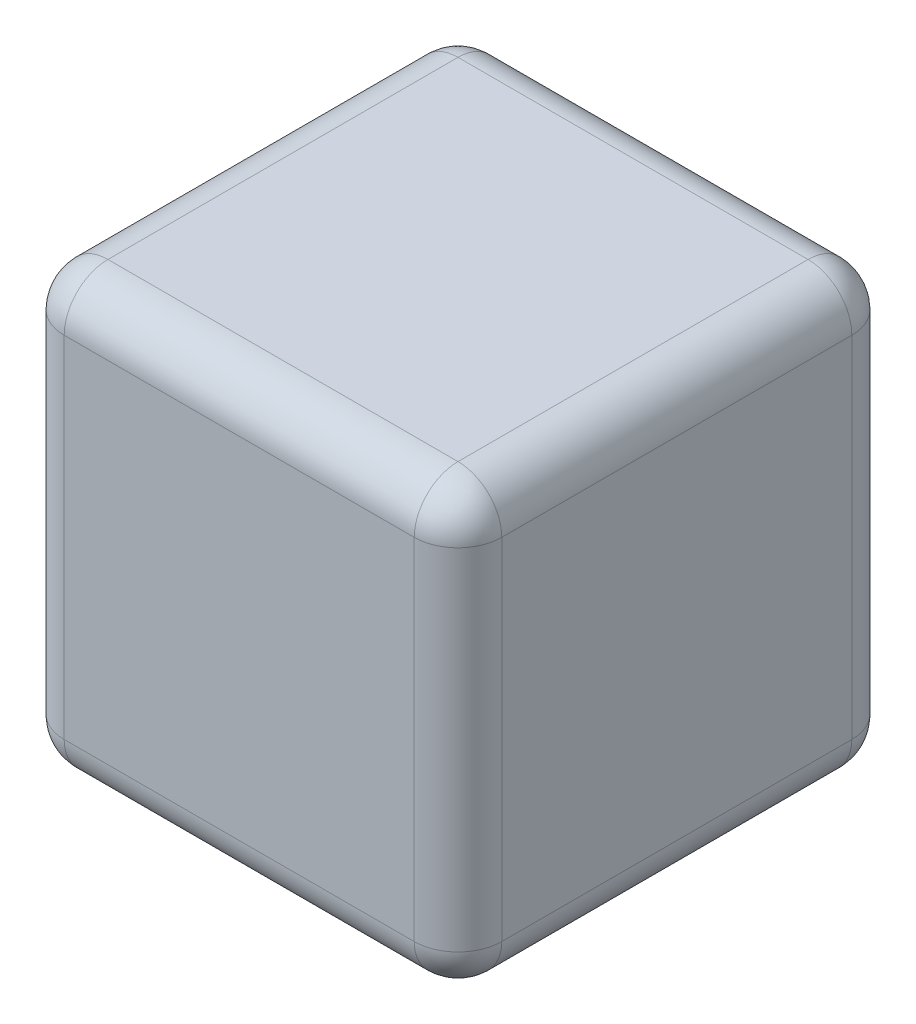
ISO-10303-21;
HEADER;
FILE_DESCRIPTION(('STEP AP214'),'2;1');
FILE_NAME('part.step','',(''),(''),'','','');
FILE_SCHEMA(('AUTOMOTIVE_DESIGN { 1 0 10303 214 1 1 1 1 }'));
ENDSEC;
DATA;
#1=APPLICATION_CONTEXT('core data for automotive mechanical design processes');
#2=APPLICATION_PROTOCOL_DEFINITION('international standard','automotive_design',2000,#1);
#3=PRODUCT_CONTEXT('',#1,'mechanical');
#4=PRODUCT('Part','Part','',(#3));
#5=PRODUCT_RELATED_PRODUCT_CATEGORY('part','',(#4));
#6=PRODUCT_DEFINITION_FORMATION('','',#4);
#7=PRODUCT_DEFINITION_CONTEXT('part definition',#1,'design');
#8=PRODUCT_DEFINITION('design','',#6,#7);
#9=PRODUCT_DEFINITION_SHAPE('','',#8);
#10=(LENGTH_UNIT() NAMED_UNIT(*) SI_UNIT(.MILLI.,.METRE.));
#11=(NAMED_UNIT(*) PLANE_ANGLE_UNIT() SI_UNIT($,.RADIAN.));
#12=(NAMED_UNIT(*) SI_UNIT($,.STERADIAN.) SOLID_ANGLE_UNIT());
#13=UNCERTAINTY_MEASURE_WITH_UNIT(LENGTH_MEASURE(1.E-05),#10,'distance_accuracy_value','');
#14=(GEOMETRIC_REPRESENTATION_CONTEXT(3) GLOBAL_UNCERTAINTY_ASSIGNED_CONTEXT((#13)) GLOBAL_UNIT_ASSIGNED_CONTEXT((#10,
#11,#12)) REPRESENTATION_CONTEXT('',''));
#15=CARTESIAN_POINT('',(0.,0.,0.));
#16=DIRECTION('',(0.,0.,1.));
#17=DIRECTION('',(1.,0.,0.));
#18=AXIS2_PLACEMENT_3D('',#15,#16,#17);
#19=CARTESIAN_POINT('',(25.4,25.4,0.));
#20=DIRECTION('',(0.,0.,-1.));
#21=DIRECTION('',(-1.,0.,0.));
#22=AXIS2_PLACEMENT_3D('',#19,#20,#21);
#23=PLANE('',#22);
#24=DIRECTION('',(1.,0.,0.));
#25=VECTOR('',#24,1.);
#26=CARTESIAN_POINT('',(25.4,22.86,0.));
#27=LINE('',#26,#25);
#28=CARTESIAN_POINT('',(22.86,22.86,0.));
#29=VERTEX_POINT('',#28);
#30=CARTESIAN_POINT('',(2.54,22.86,0.));
#31=VERTEX_POINT('',#30);
#32=EDGE_CURVE('E265',#29,#31,#27,.F.);
#33=ORIENTED_EDGE('',*,*,#32,.T.);
#34=DIRECTION('',(0.,-1.,0.));
#35=VECTOR('',#34,1.);
#36=CARTESIAN_POINT('',(2.54,25.4,0.));
#37=LINE('',#36,#35);
#38=CARTESIAN_POINT('',(2.54,2.54,0.));
#39=VERTEX_POINT('',#38);
#40=EDGE_CURVE('E170',#31,#39,#37,.T.);
#41=ORIENTED_EDGE('',*,*,#40,.T.);
#42=DIRECTION('',(1.,0.,0.));
#43=VECTOR('',#42,1.);
#44=CARTESIAN_POINT('',(25.4,2.54,0.));
#45=LINE('',#44,#43);
#46=CARTESIAN_POINT('',(22.86,2.54,0.));
#47=VERTEX_POINT('',#46);
#48=EDGE_CURVE('E271',#39,#47,#45,.T.);
#49=ORIENTED_EDGE('',*,*,#48,.T.);
#50=DIRECTION('',(0.,-1.,0.));
#51=VECTOR('',#50,1.);
#52=CARTESIAN_POINT('',(22.86,25.4,0.));
#53=LINE('',#52,#51);
#54=EDGE_CURVE('E268',#47,#29,#53,.F.);
#55=ORIENTED_EDGE('',*,*,#54,.T.);
#56=EDGE_LOOP('',(#33,#41,#49,#55));
#57=FACE_BOUND('',#56,.T.);
#58=ADVANCED_FACE('F45',(#57),#23,.F.);
#59=CARTESIAN_POINT('',(25.4,25.4,-25.4));
#60=DIRECTION('',(-1.,0.,0.));
#61=DIRECTION('',(0.,0.,1.));
#62=AXIS2_PLACEMENT_3D('',#59,#60,#61);
#63=PLANE('',#62);
#64=DIRECTION('',(0.,-1.,0.));
#65=VECTOR('',#64,1.);
#66=CARTESIAN_POINT('',(25.4,25.4,-2.54));
#67=LINE('',#66,#65);
#68=CARTESIAN_POINT('',(25.4,22.86,-2.54));
#69=VERTEX_POINT('',#68);
#70=CARTESIAN_POINT('',(25.4,2.54,-2.54));
#71=VERTEX_POINT('',#70);
#72=EDGE_CURVE('E281',#69,#71,#67,.T.);
#73=ORIENTED_EDGE('',*,*,#72,.T.);
#74=DIRECTION('',(0.,0.,-1.));
#75=VECTOR('',#74,1.);
#76=CARTESIAN_POINT('',(25.4,2.54,-25.4));
#77=LINE('',#76,#75);
#78=CARTESIAN_POINT('',(25.4,2.54,-22.86));
#79=VERTEX_POINT('',#78);
#80=EDGE_CURVE('E285',#71,#79,#77,.T.);
#81=ORIENTED_EDGE('',*,*,#80,.T.);
#82=DIRECTION('',(0.,-1.,0.));
#83=VECTOR('',#82,1.);
#84=CARTESIAN_POINT('',(25.4,25.4,-22.86));
#85=LINE('',#84,#83);
#86=CARTESIAN_POINT('',(25.4,22.86,-22.86));
#87=VERTEX_POINT('',#86);
#88=EDGE_CURVE('E245',#79,#87,#85,.F.);
#89=ORIENTED_EDGE('',*,*,#88,.T.);
#90=DIRECTION('',(0.,0.,-1.));
#91=VECTOR('',#90,1.);
#92=CARTESIAN_POINT('',(25.4,22.86,-25.4));
#93=LINE('',#92,#91);
#94=EDGE_CURVE('E276',#87,#69,#93,.F.);
#95=ORIENTED_EDGE('',*,*,#94,.T.);
#96=EDGE_LOOP('',(#73,#81,#89,#95));
#97=FACE_BOUND('',#96,.T.);
#98=ADVANCED_FACE('F369',(#97),#63,.F.);
#99=CARTESIAN_POINT('',(0.,25.4,-25.4));
#100=DIRECTION('',(0.,0.,1.));
#101=DIRECTION('',(1.,0.,0.));
#102=AXIS2_PLACEMENT_3D('',#99,#100,#101);
#103=PLANE('',#102);
#104=DIRECTION('',(-1.,0.,0.));
#105=VECTOR('',#104,1.);
#106=CARTESIAN_POINT('',(0.,2.54,-25.4));
#107=LINE('',#106,#105);
#108=CARTESIAN_POINT('',(22.86,2.54,-25.4));
#109=VERTEX_POINT('',#108);
#110=CARTESIAN_POINT('',(2.54,2.54,-25.4));
#111=VERTEX_POINT('',#110);
#112=EDGE_CURVE('E251',#109,#111,#107,.T.);
#113=ORIENTED_EDGE('',*,*,#112,.T.);
#114=DIRECTION('',(0.,-1.,0.));
#115=VECTOR('',#114,1.);
#116=CARTESIAN_POINT('',(2.54,25.4,-25.4));
#117=LINE('',#116,#115);
#118=CARTESIAN_POINT('',(2.54,22.86,-25.4));
#119=VERTEX_POINT('',#118);
#120=EDGE_CURVE('E256',#111,#119,#117,.F.);
#121=ORIENTED_EDGE('',*,*,#120,.T.);
#122=DIRECTION('',(-1.,0.,0.));
#123=VECTOR('',#122,1.);
#124=CARTESIAN_POINT('',(0.,22.86,-25.4));
#125=LINE('',#124,#123);
#126=CARTESIAN_POINT('',(22.86,22.86,-25.4));
#127=VERTEX_POINT('',#126);
#128=EDGE_CURVE('E252',#119,#127,#125,.F.);
#129=ORIENTED_EDGE('',*,*,#128,.T.);
#130=DIRECTION('',(0.,-1.,0.));
#131=VECTOR('',#130,1.);
#132=CARTESIAN_POINT('',(22.86,25.4,-25.4));
#133=LINE('',#132,#131);
#134=EDGE_CURVE('E247',#127,#109,#133,.T.);
#135=ORIENTED_EDGE('',*,*,#134,.T.);
#136=EDGE_LOOP('',(#113,#121,#129,#135));
#137=FACE_BOUND('',#136,.T.);
#138=ADVANCED_FACE('F349',(#137),#103,.F.);
#139=CARTESIAN_POINT('',(0.,25.4,0.));
#140=DIRECTION('',(1.,0.,0.));
#141=DIRECTION('',(0.,0.,-1.));
#142=AXIS2_PLACEMENT_3D('',#139,#140,#141);
#143=PLANE('',#142);
#144=DIRECTION('',(0.,-1.,0.));
#145=VECTOR('',#144,1.);
#146=CARTESIAN_POINT('',(0.,25.4,-22.86));
#147=LINE('',#146,#145);
#148=CARTESIAN_POINT('',(0.,22.86,-22.86));
#149=VERTEX_POINT('',#148);
#150=CARTESIAN_POINT('',(0.,2.54,-22.86));
#151=VERTEX_POINT('',#150);
#152=EDGE_CURVE('E146',#149,#151,#147,.T.);
#153=ORIENTED_EDGE('',*,*,#152,.T.);
#154=DIRECTION('',(0.,0.,1.));
#155=VECTOR('',#154,1.);
#156=CARTESIAN_POINT('',(0.,2.54,0.));
#157=LINE('',#156,#155);
#158=CARTESIAN_POINT('',(0.,2.54,-2.54));
#159=VERTEX_POINT('',#158);
#160=EDGE_CURVE('E141',#151,#159,#157,.T.);
#161=ORIENTED_EDGE('',*,*,#160,.T.);
#162=DIRECTION('',(0.,-1.,0.));
#163=VECTOR('',#162,1.);
#164=CARTESIAN_POINT('',(0.,25.4,-2.54));
#165=LINE('',#164,#163);
#166=CARTESIAN_POINT('',(0.,22.86,-2.54));
#167=VERTEX_POINT('',#166);
#168=EDGE_CURVE('E135',#159,#167,#165,.F.);
#169=ORIENTED_EDGE('',*,*,#168,.T.);
#170=DIRECTION('',(0.,0.,1.));
#171=VECTOR('',#170,1.);
#172=CARTESIAN_POINT('',(0.,22.86,0.));
#173=LINE('',#172,#171);
#174=EDGE_CURVE('E138',#167,#149,#173,.F.);
#175=ORIENTED_EDGE('',*,*,#174,.T.);
#176=EDGE_LOOP('',(#153,#161,#169,#175));
#177=FACE_BOUND('',#176,.T.);
#178=ADVANCED_FACE('F137',(#177),#143,.F.);
#179=CARTESIAN_POINT('',(0.,25.4,0.));
#180=DIRECTION('',(0.,-1.,0.));
#181=DIRECTION('',(0.,0.,-1.));
#182=AXIS2_PLACEMENT_3D('',#179,#180,#181);
#183=PLANE('',#182);
#184=DIRECTION('',(-1.,0.,0.));
#185=VECTOR('',#184,1.);
#186=CARTESIAN_POINT('',(0.,25.4,-22.86));
#187=LINE('',#186,#185);
#188=CARTESIAN_POINT('',(22.86,25.4,-22.86));
#189=VERTEX_POINT('',#188);
#190=CARTESIAN_POINT('',(2.54,25.4,-22.86));
#191=VERTEX_POINT('',#190);
#192=EDGE_CURVE('E55',#189,#191,#187,.T.);
#193=ORIENTED_EDGE('',*,*,#192,.T.);
#194=DIRECTION('',(0.,0.,1.));
#195=VECTOR('',#194,1.);
#196=CARTESIAN_POINT('',(2.54,25.4,0.));
#197=LINE('',#196,#195);
#198=CARTESIAN_POINT('',(2.54,25.4,-2.54));
#199=VERTEX_POINT('',#198);
#200=EDGE_CURVE('E11',#191,#199,#197,.T.);
#201=ORIENTED_EDGE('',*,*,#200,.T.);
#202=DIRECTION('',(1.,0.,0.));
#203=VECTOR('',#202,1.);
#204=CARTESIAN_POINT('',(0.,25.4,-2.54));
#205=LINE('',#204,#203);
#206=CARTESIAN_POINT('',(22.86,25.4,-2.54));
#207=VERTEX_POINT('',#206);
#208=EDGE_CURVE('E288',#199,#207,#205,.T.);
#209=ORIENTED_EDGE('',*,*,#208,.T.);
#210=DIRECTION('',(0.,0.,-1.));
#211=VECTOR('',#210,1.);
#212=CARTESIAN_POINT('',(22.86,25.4,0.));
#213=LINE('',#212,#211);
#214=EDGE_CURVE('E66',#207,#189,#213,.T.);
#215=ORIENTED_EDGE('',*,*,#214,.T.);
#216=EDGE_LOOP('',(#193,#201,#209,#215));
#217=FACE_BOUND('',#216,.T.);
#218=ADVANCED_FACE('F416',(#217),#183,.F.);
#219=CARTESIAN_POINT('',(0.,0.,0.));
#220=DIRECTION('',(0.,-1.,0.));
#221=DIRECTION('',(0.,0.,-1.));
#222=AXIS2_PLACEMENT_3D('',#219,#220,#221);
#223=PLANE('',#222);
#224=DIRECTION('',(1.,0.,0.));
#225=VECTOR('',#224,1.);
#226=CARTESIAN_POINT('',(0.,0.,-2.54));
#227=LINE('',#226,#225);
#228=CARTESIAN_POINT('',(22.86,0.,-2.54));
#229=VERTEX_POINT('',#228);
#230=CARTESIAN_POINT('',(2.54,0.,-2.54));
#231=VERTEX_POINT('',#230);
#232=EDGE_CURVE('E327',#229,#231,#227,.F.);
#233=ORIENTED_EDGE('',*,*,#232,.T.);
#234=DIRECTION('',(0.,0.,1.));
#235=VECTOR('',#234,1.);
#236=CARTESIAN_POINT('',(2.54,0.,-25.4));
#237=LINE('',#236,#235);
#238=CARTESIAN_POINT('',(2.54,0.,-22.86));
#239=VERTEX_POINT('',#238);
#240=EDGE_CURVE('E258',#231,#239,#237,.F.);
#241=ORIENTED_EDGE('',*,*,#240,.T.);
#242=DIRECTION('',(-1.,0.,0.));
#243=VECTOR('',#242,1.);
#244=CARTESIAN_POINT('',(25.4,0.,-22.86));
#245=LINE('',#244,#243);
#246=CARTESIAN_POINT('',(22.86,0.,-22.86));
#247=VERTEX_POINT('',#246);
#248=EDGE_CURVE('E321',#239,#247,#245,.F.);
#249=ORIENTED_EDGE('',*,*,#248,.T.);
#250=DIRECTION('',(0.,0.,-1.));
#251=VECTOR('',#250,1.);
#252=CARTESIAN_POINT('',(22.86,0.,0.));
#253=LINE('',#252,#251);
#254=EDGE_CURVE('E339',#247,#229,#253,.F.);
#255=ORIENTED_EDGE('',*,*,#254,.T.);
#256=EDGE_LOOP('',(#233,#241,#249,#255));
#257=FACE_BOUND('',#256,.T.);
#258=ADVANCED_FACE('F330',(#257),#223,.T.);
#259=CARTESIAN_POINT('',(22.86,22.86,0.));
#260=DIRECTION('',(0.,0.,-1.));
#261=DIRECTION('',(-1.,0.,0.));
#262=AXIS2_PLACEMENT_3D('',#259,#260,#261);
#263=CYLINDRICAL_SURFACE('',#262,2.54);
#264=CARTESIAN_POINT('',(22.86,22.86,-22.86));
#265=DIRECTION('',(0.,0.,-1.));
#266=DIRECTION('',(-1.,0.,0.));
#267=AXIS2_PLACEMENT_3D('',#264,#265,#266);
#268=CIRCLE('',#267,2.54);
#269=EDGE_CURVE('E49',#189,#87,#268,.T.);
#270=ORIENTED_EDGE('',*,*,#269,.F.);
#271=ORIENTED_EDGE('',*,*,#214,.F.);
#272=CARTESIAN_POINT('',(22.86,22.86,-2.54));
#273=DIRECTION('',(0.,0.,1.));
#274=DIRECTION('',(0.,-1.,0.));
#275=AXIS2_PLACEMENT_3D('',#272,#273,#274);
#276=CIRCLE('',#275,2.54);
#277=EDGE_CURVE('E225',#69,#207,#276,.T.);
#278=ORIENTED_EDGE('',*,*,#277,.F.);
#279=ORIENTED_EDGE('',*,*,#94,.F.);
#280=EDGE_LOOP('',(#270,#271,#278,#279));
#281=FACE_BOUND('',#280,.T.);
#282=ADVANCED_FACE('F47',(#281),#263,.T.);
#283=CARTESIAN_POINT('',(22.86,22.86,-22.86));
#284=DIRECTION('',(1.,0.,0.));
#285=DIRECTION('',(0.,0.,-1.));
#286=AXIS2_PLACEMENT_3D('',#283,#284,#285);
#287=SPHERICAL_SURFACE('',#286,2.54);
#288=CARTESIAN_POINT('',(22.86,22.86,-22.86));
#289=DIRECTION('',(1.,0.,0.));
#290=DIRECTION('',(0.,0.,-1.));
#291=AXIS2_PLACEMENT_3D('',#288,#289,#290);
#292=CIRCLE('',#291,2.54);
#293=EDGE_CURVE('E218',#189,#127,#292,.F.);
#294=ORIENTED_EDGE('',*,*,#293,.F.);
#295=ORIENTED_EDGE('',*,*,#269,.T.);
#296=CARTESIAN_POINT('',(22.86,22.86,-22.86));
#297=DIRECTION('',(0.,1.,0.));
#298=DIRECTION('',(0.,0.,1.));
#299=AXIS2_PLACEMENT_3D('',#296,#297,#298);
#300=CIRCLE('',#299,2.54);
#301=EDGE_CURVE('E222',#127,#87,#300,.F.);
#302=ORIENTED_EDGE('',*,*,#301,.F.);
#303=EDGE_LOOP('',(#294,#295,#302));
#304=FACE_BOUND('',#303,.T.);
#305=ADVANCED_FACE('F237',(#304),#287,.T.);
#306=CARTESIAN_POINT('',(22.86,22.86,-2.54));
#307=DIRECTION('',(0.,1.,0.));
#308=DIRECTION('',(0.,0.,1.));
#309=AXIS2_PLACEMENT_3D('',#306,#307,#308);
#310=SPHERICAL_SURFACE('',#309,2.54);
#311=CARTESIAN_POINT('',(22.86,22.86,-2.54));
#312=DIRECTION('',(0.,1.,0.));
#313=DIRECTION('',(0.,0.,1.));
#314=AXIS2_PLACEMENT_3D('',#311,#312,#313);
#315=CIRCLE('',#314,2.54);
#316=EDGE_CURVE('E210',#69,#29,#315,.F.);
#317=ORIENTED_EDGE('',*,*,#316,.F.);
#318=ORIENTED_EDGE('',*,*,#277,.T.);
#319=CARTESIAN_POINT('',(22.86,22.86,-2.54));
#320=DIRECTION('',(1.,0.,0.));
#321=DIRECTION('',(0.,0.,-1.));
#322=AXIS2_PLACEMENT_3D('',#319,#320,#321);
#323=CIRCLE('',#322,2.54);
#324=EDGE_CURVE('E214',#29,#207,#323,.F.);
#325=ORIENTED_EDGE('',*,*,#324,.F.);
#326=EDGE_LOOP('',(#317,#318,#325));
#327=FACE_BOUND('',#326,.T.);
#328=ADVANCED_FACE('F411',(#327),#310,.T.);
#329=CARTESIAN_POINT('',(22.86,25.4,-22.86));
#330=DIRECTION('',(0.,-1.,0.));
#331=DIRECTION('',(0.,0.,-1.));
#332=AXIS2_PLACEMENT_3D('',#329,#330,#331);
#333=CYLINDRICAL_SURFACE('',#332,2.54);
#334=ORIENTED_EDGE('',*,*,#301,.T.);
#335=ORIENTED_EDGE('',*,*,#88,.F.);
#336=CARTESIAN_POINT('',(22.86,2.54,-22.86));
#337=DIRECTION('',(0.,-1.,0.));
#338=DIRECTION('',(0.,0.,-1.));
#339=AXIS2_PLACEMENT_3D('',#336,#337,#338);
#340=CIRCLE('',#339,2.54);
#341=EDGE_CURVE('E202',#109,#79,#340,.T.);
#342=ORIENTED_EDGE('',*,*,#341,.F.);
#343=ORIENTED_EDGE('',*,*,#134,.F.);
#344=EDGE_LOOP('',(#334,#335,#342,#343));
#345=FACE_BOUND('',#344,.T.);
#346=ADVANCED_FACE('F243',(#345),#333,.T.);
#347=CARTESIAN_POINT('',(0.,22.86,-22.86));
#348=DIRECTION('',(-1.,0.,0.));
#349=DIRECTION('',(0.,0.,1.));
#350=AXIS2_PLACEMENT_3D('',#347,#348,#349);
#351=CYLINDRICAL_SURFACE('',#350,2.54);
#352=ORIENTED_EDGE('',*,*,#293,.T.);
#353=ORIENTED_EDGE('',*,*,#128,.F.);
#354=CARTESIAN_POINT('',(2.54,22.86,-22.86));
#355=DIRECTION('',(-1.,0.,0.));
#356=DIRECTION('',(0.,0.,1.));
#357=AXIS2_PLACEMENT_3D('',#354,#355,#356);
#358=CIRCLE('',#357,2.54);
#359=EDGE_CURVE('E198',#191,#119,#358,.T.);
#360=ORIENTED_EDGE('',*,*,#359,.F.);
#361=ORIENTED_EDGE('',*,*,#192,.F.);
#362=EDGE_LOOP('',(#352,#353,#360,#361));
#363=FACE_BOUND('',#362,.T.);
#364=ADVANCED_FACE('F353',(#363),#351,.T.);
#365=CARTESIAN_POINT('',(2.54,22.86,0.));
#366=DIRECTION('',(0.,0.,1.));
#367=DIRECTION('',(1.,0.,0.));
#368=AXIS2_PLACEMENT_3D('',#365,#366,#367);
#369=CYLINDRICAL_SURFACE('',#368,2.54);
#370=CARTESIAN_POINT('',(2.54,22.86,-2.54));
#371=DIRECTION('',(0.,0.,1.));
#372=DIRECTION('',(1.,0.,0.));
#373=AXIS2_PLACEMENT_3D('',#370,#371,#372);
#374=CIRCLE('',#373,2.54);
#375=EDGE_CURVE('E152',#199,#167,#374,.T.);
#376=ORIENTED_EDGE('',*,*,#375,.F.);
#377=ORIENTED_EDGE('',*,*,#200,.F.);
#378=CARTESIAN_POINT('',(2.54,22.86,-22.86));
#379=DIRECTION('',(0.,0.,-1.));
#380=DIRECTION('',(-1.,0.,0.));
#381=AXIS2_PLACEMENT_3D('',#378,#379,#380);
#382=CIRCLE('',#381,2.54);
#383=EDGE_CURVE('E155',#149,#191,#382,.T.);
#384=ORIENTED_EDGE('',*,*,#383,.F.);
#385=ORIENTED_EDGE('',*,*,#174,.F.);
#386=EDGE_LOOP('',(#376,#377,#384,#385));
#387=FACE_BOUND('',#386,.T.);
#388=ADVANCED_FACE('F151',(#387),#369,.T.);
#389=CARTESIAN_POINT('',(0.,22.86,-2.54));
#390=DIRECTION('',(1.,0.,0.));
#391=DIRECTION('',(0.,0.,-1.));
#392=AXIS2_PLACEMENT_3D('',#389,#390,#391);
#393=CYLINDRICAL_SURFACE('',#392,2.54);
#394=ORIENTED_EDGE('',*,*,#324,.T.);
#395=ORIENTED_EDGE('',*,*,#208,.F.);
#396=CARTESIAN_POINT('',(2.54,22.86,-2.54));
#397=DIRECTION('',(-1.,0.,0.));
#398=DIRECTION('',(0.,-1.,0.));
#399=AXIS2_PLACEMENT_3D('',#396,#397,#398);
#400=CIRCLE('',#399,2.54);
#401=EDGE_CURVE('E165',#31,#199,#400,.T.);
#402=ORIENTED_EDGE('',*,*,#401,.F.);
#403=ORIENTED_EDGE('',*,*,#32,.F.);
#404=EDGE_LOOP('',(#394,#395,#402,#403));
#405=FACE_BOUND('',#404,.T.);
#406=ADVANCED_FACE('F414',(#405),#393,.T.);
#407=CARTESIAN_POINT('',(22.86,25.4,-2.54));
#408=DIRECTION('',(0.,-1.,0.));
#409=DIRECTION('',(0.,0.,-1.));
#410=AXIS2_PLACEMENT_3D('',#407,#408,#409);
#411=CYLINDRICAL_SURFACE('',#410,2.54);
#412=ORIENTED_EDGE('',*,*,#316,.T.);
#413=ORIENTED_EDGE('',*,*,#54,.F.);
#414=CARTESIAN_POINT('',(22.86,2.54,-2.54));
#415=DIRECTION('',(0.,-1.,0.));
#416=DIRECTION('',(0.,0.,-1.));
#417=AXIS2_PLACEMENT_3D('',#414,#415,#416);
#418=CIRCLE('',#417,2.54);
#419=EDGE_CURVE('E190',#71,#47,#418,.T.);
#420=ORIENTED_EDGE('',*,*,#419,.F.);
#421=ORIENTED_EDGE('',*,*,#72,.F.);
#422=EDGE_LOOP('',(#412,#413,#420,#421));
#423=FACE_BOUND('',#422,.T.);
#424=ADVANCED_FACE('F410',(#423),#411,.T.);
#425=CARTESIAN_POINT('',(22.86,2.54,-25.4));
#426=DIRECTION('',(0.,0.,1.));
#427=DIRECTION('',(1.,0.,0.));
#428=AXIS2_PLACEMENT_3D('',#425,#426,#427);
#429=CYLINDRICAL_SURFACE('',#428,2.54);
#430=CARTESIAN_POINT('',(22.86,2.54,-22.86));
#431=DIRECTION('',(0.,0.,-1.));
#432=DIRECTION('',(-1.,0.,0.));
#433=AXIS2_PLACEMENT_3D('',#430,#431,#432);
#434=CIRCLE('',#433,2.54);
#435=EDGE_CURVE('E206',#79,#247,#434,.T.);
#436=ORIENTED_EDGE('',*,*,#435,.F.);
#437=ORIENTED_EDGE('',*,*,#80,.F.);
#438=CARTESIAN_POINT('',(22.86,2.54,-2.54));
#439=DIRECTION('',(0.,0.,1.));
#440=DIRECTION('',(1.,0.,0.));
#441=AXIS2_PLACEMENT_3D('',#438,#439,#440);
#442=CIRCLE('',#441,2.54);
#443=EDGE_CURVE('E187',#229,#71,#442,.T.);
#444=ORIENTED_EDGE('',*,*,#443,.F.);
#445=ORIENTED_EDGE('',*,*,#254,.F.);
#446=EDGE_LOOP('',(#436,#437,#444,#445));
#447=FACE_BOUND('',#446,.T.);
#448=ADVANCED_FACE('F365',(#447),#429,.T.);
#449=CARTESIAN_POINT('',(22.86,2.54,-22.86));
#450=DIRECTION('',(1.,0.,0.));
#451=DIRECTION('',(0.,1.,0.));
#452=AXIS2_PLACEMENT_3D('',#449,#450,#451);
#453=SPHERICAL_SURFACE('',#452,2.54);
#454=ORIENTED_EDGE('',*,*,#341,.T.);
#455=ORIENTED_EDGE('',*,*,#435,.T.);
#456=CARTESIAN_POINT('',(22.86,2.54,-22.86));
#457=DIRECTION('',(1.,0.,0.));
#458=DIRECTION('',(0.,0.,-1.));
#459=AXIS2_PLACEMENT_3D('',#456,#457,#458);
#460=CIRCLE('',#459,2.54);
#461=EDGE_CURVE('E177',#109,#247,#460,.F.);
#462=ORIENTED_EDGE('',*,*,#461,.F.);
#463=EDGE_LOOP('',(#454,#455,#462));
#464=FACE_BOUND('',#463,.T.);
#465=ADVANCED_FACE('F357',(#464),#453,.T.);
#466=CARTESIAN_POINT('',(2.54,22.86,-22.86));
#467=DIRECTION('',(0.,1.,0.));
#468=DIRECTION('',(0.,0.,1.));
#469=AXIS2_PLACEMENT_3D('',#466,#467,#468);
#470=SPHERICAL_SURFACE('',#469,2.54);
#471=ORIENTED_EDGE('',*,*,#383,.T.);
#472=ORIENTED_EDGE('',*,*,#359,.T.);
#473=CARTESIAN_POINT('',(2.54,22.86,-22.86));
#474=DIRECTION('',(0.,1.,0.));
#475=DIRECTION('',(0.,0.,1.));
#476=AXIS2_PLACEMENT_3D('',#473,#474,#475);
#477=CIRCLE('',#476,2.54);
#478=EDGE_CURVE('E172',#149,#119,#477,.F.);
#479=ORIENTED_EDGE('',*,*,#478,.F.);
#480=EDGE_LOOP('',(#471,#472,#479));
#481=FACE_BOUND('',#480,.T.);
#482=ADVANCED_FACE('F355',(#481),#470,.T.);
#483=CARTESIAN_POINT('',(2.54,22.86,-2.54));
#484=DIRECTION('',(0.,1.,0.));
#485=DIRECTION('',(0.,0.,1.));
#486=AXIS2_PLACEMENT_3D('',#483,#484,#485);
#487=SPHERICAL_SURFACE('',#486,2.54);
#488=ORIENTED_EDGE('',*,*,#401,.T.);
#489=ORIENTED_EDGE('',*,*,#375,.T.);
#490=CARTESIAN_POINT('',(2.54,22.86,-2.54));
#491=DIRECTION('',(0.,1.,0.));
#492=DIRECTION('',(0.,0.,1.));
#493=AXIS2_PLACEMENT_3D('',#490,#491,#492);
#494=CIRCLE('',#493,2.54);
#495=EDGE_CURVE('E162',#31,#167,#494,.F.);
#496=ORIENTED_EDGE('',*,*,#495,.F.);
#497=EDGE_LOOP('',(#488,#489,#496));
#498=FACE_BOUND('',#497,.T.);
#499=ADVANCED_FACE('F161',(#498),#487,.T.);
#500=CARTESIAN_POINT('',(22.86,2.54,-2.54));
#501=DIRECTION('',(1.,0.,0.));
#502=DIRECTION('',(0.,0.,-1.));
#503=AXIS2_PLACEMENT_3D('',#500,#501,#502);
#504=SPHERICAL_SURFACE('',#503,2.54);
#505=ORIENTED_EDGE('',*,*,#443,.T.);
#506=ORIENTED_EDGE('',*,*,#419,.T.);
#507=CARTESIAN_POINT('',(22.86,2.54,-2.54));
#508=DIRECTION('',(1.,0.,0.));
#509=DIRECTION('',(0.,0.,-1.));
#510=AXIS2_PLACEMENT_3D('',#507,#508,#509);
#511=CIRCLE('',#510,2.54);
#512=EDGE_CURVE('E173',#229,#47,#511,.F.);
#513=ORIENTED_EDGE('',*,*,#512,.F.);
#514=EDGE_LOOP('',(#505,#506,#513));
#515=FACE_BOUND('',#514,.T.);
#516=ADVANCED_FACE('F363',(#515),#504,.T.);
#517=CARTESIAN_POINT('',(0.,2.54,-22.86));
#518=DIRECTION('',(1.,0.,0.));
#519=DIRECTION('',(0.,0.,-1.));
#520=AXIS2_PLACEMENT_3D('',#517,#518,#519);
#521=CYLINDRICAL_SURFACE('',#520,2.54);
#522=ORIENTED_EDGE('',*,*,#461,.T.);
#523=ORIENTED_EDGE('',*,*,#248,.F.);
#524=CARTESIAN_POINT('',(2.54,2.54,-22.86));
#525=DIRECTION('',(-1.,0.,0.));
#526=DIRECTION('',(0.,0.,1.));
#527=AXIS2_PLACEMENT_3D('',#524,#525,#526);
#528=CIRCLE('',#527,2.54);
#529=EDGE_CURVE('E180',#111,#239,#528,.T.);
#530=ORIENTED_EDGE('',*,*,#529,.F.);
#531=ORIENTED_EDGE('',*,*,#112,.F.);
#532=EDGE_LOOP('',(#522,#523,#530,#531));
#533=FACE_BOUND('',#532,.T.);
#534=ADVANCED_FACE('F323',(#533),#521,.T.);
#535=CARTESIAN_POINT('',(2.54,25.4,-22.86));
#536=DIRECTION('',(0.,-1.,0.));
#537=DIRECTION('',(0.,0.,-1.));
#538=AXIS2_PLACEMENT_3D('',#535,#536,#537);
#539=CYLINDRICAL_SURFACE('',#538,2.54);
#540=ORIENTED_EDGE('',*,*,#478,.T.);
#541=ORIENTED_EDGE('',*,*,#120,.F.);
#542=CARTESIAN_POINT('',(2.54,2.54,-22.86));
#543=DIRECTION('',(0.,-1.,0.));
#544=DIRECTION('',(0.,0.,-1.));
#545=AXIS2_PLACEMENT_3D('',#542,#543,#544);
#546=CIRCLE('',#545,2.54);
#547=EDGE_CURVE('E308',#151,#111,#546,.T.);
#548=ORIENTED_EDGE('',*,*,#547,.F.);
#549=ORIENTED_EDGE('',*,*,#152,.F.);
#550=EDGE_LOOP('',(#540,#541,#548,#549));
#551=FACE_BOUND('',#550,.T.);
#552=ADVANCED_FACE('F348',(#551),#539,.T.);
#553=CARTESIAN_POINT('',(2.54,25.4,-2.54));
#554=DIRECTION('',(0.,-1.,0.));
#555=DIRECTION('',(0.,0.,-1.));
#556=AXIS2_PLACEMENT_3D('',#553,#554,#555);
#557=CYLINDRICAL_SURFACE('',#556,2.54);
#558=ORIENTED_EDGE('',*,*,#495,.T.);
#559=ORIENTED_EDGE('',*,*,#168,.F.);
#560=CARTESIAN_POINT('',(2.54,2.54,-2.54));
#561=DIRECTION('',(0.,-1.,0.));
#562=DIRECTION('',(0.,0.,-1.));
#563=AXIS2_PLACEMENT_3D('',#560,#561,#562);
#564=CIRCLE('',#563,2.54);
#565=EDGE_CURVE('E304',#39,#159,#564,.T.);
#566=ORIENTED_EDGE('',*,*,#565,.F.);
#567=ORIENTED_EDGE('',*,*,#40,.F.);
#568=EDGE_LOOP('',(#558,#559,#566,#567));
#569=FACE_BOUND('',#568,.T.);
#570=ADVANCED_FACE('F168',(#569),#557,.T.);
#571=CARTESIAN_POINT('',(25.4,2.54,-2.54));
#572=DIRECTION('',(-1.,0.,0.));
#573=DIRECTION('',(0.,0.,1.));
#574=AXIS2_PLACEMENT_3D('',#571,#572,#573);
#575=CYLINDRICAL_SURFACE('',#574,2.54);
#576=ORIENTED_EDGE('',*,*,#512,.T.);
#577=ORIENTED_EDGE('',*,*,#48,.F.);
#578=CARTESIAN_POINT('',(2.54,2.54,-2.54));
#579=DIRECTION('',(-1.,0.,0.));
#580=DIRECTION('',(0.,0.,1.));
#581=AXIS2_PLACEMENT_3D('',#578,#579,#580);
#582=CIRCLE('',#581,2.54);
#583=EDGE_CURVE('E301',#231,#39,#582,.T.);
#584=ORIENTED_EDGE('',*,*,#583,.F.);
#585=ORIENTED_EDGE('',*,*,#232,.F.);
#586=EDGE_LOOP('',(#576,#577,#584,#585));
#587=FACE_BOUND('',#586,.T.);
#588=ADVANCED_FACE('F388',(#587),#575,.T.);
#589=CARTESIAN_POINT('',(2.54,2.54,-22.86));
#590=DIRECTION('',(0.,0.,-1.));
#591=DIRECTION('',(0.,1.,0.));
#592=AXIS2_PLACEMENT_3D('',#589,#590,#591);
#593=SPHERICAL_SURFACE('',#592,2.54);
#594=ORIENTED_EDGE('',*,*,#547,.T.);
#595=ORIENTED_EDGE('',*,*,#529,.T.);
#596=CARTESIAN_POINT('',(2.54,2.54,-22.86));
#597=DIRECTION('',(0.,0.,-1.));
#598=DIRECTION('',(-1.,0.,0.));
#599=AXIS2_PLACEMENT_3D('',#596,#597,#598);
#600=CIRCLE('',#599,2.54);
#601=EDGE_CURVE('E298',#151,#239,#600,.F.);
#602=ORIENTED_EDGE('',*,*,#601,.F.);
#603=EDGE_LOOP('',(#594,#595,#602));
#604=FACE_BOUND('',#603,.T.);
#605=ADVANCED_FACE('F317',(#604),#593,.T.);
#606=CARTESIAN_POINT('',(2.54,2.54,-2.54));
#607=DIRECTION('',(0.,0.,1.));
#608=DIRECTION('',(1.,0.,0.));
#609=AXIS2_PLACEMENT_3D('',#606,#607,#608);
#610=SPHERICAL_SURFACE('',#609,2.54);
#611=ORIENTED_EDGE('',*,*,#583,.T.);
#612=ORIENTED_EDGE('',*,*,#565,.T.);
#613=CARTESIAN_POINT('',(2.54,2.54,-2.54));
#614=DIRECTION('',(0.,0.,1.));
#615=DIRECTION('',(0.,-1.,0.));
#616=AXIS2_PLACEMENT_3D('',#613,#614,#615);
#617=CIRCLE('',#616,2.54);
#618=EDGE_CURVE('E295',#231,#159,#617,.F.);
#619=ORIENTED_EDGE('',*,*,#618,.F.);
#620=EDGE_LOOP('',(#611,#612,#619));
#621=FACE_BOUND('',#620,.T.);
#622=ADVANCED_FACE('F382',(#621),#610,.T.);
#623=CARTESIAN_POINT('',(2.54,2.54,0.));
#624=DIRECTION('',(0.,0.,-1.));
#625=DIRECTION('',(-1.,0.,0.));
#626=AXIS2_PLACEMENT_3D('',#623,#624,#625);
#627=CYLINDRICAL_SURFACE('',#626,2.54);
#628=ORIENTED_EDGE('',*,*,#601,.T.);
#629=ORIENTED_EDGE('',*,*,#240,.F.);
#630=ORIENTED_EDGE('',*,*,#618,.T.);
#631=ORIENTED_EDGE('',*,*,#160,.F.);
#632=EDGE_LOOP('',(#628,#629,#630,#631));
#633=FACE_BOUND('',#632,.T.);
#634=ADVANCED_FACE('F379',(#633),#627,.T.);
#635=CLOSED_SHELL('',(#58,#98,#138,#178,#218,#258,#282,#305,#328,#346,#364,#388,#406,#424,#448,
#465,#482,#499,#516,#534,#552,#570,#588,#605,#622,#634));
#636=MANIFOLD_SOLID_BREP('B2',#635);
#637=ADVANCED_BREP_SHAPE_REPRESENTATION('',(#18,#636),#14);
#638=SHAPE_DEFINITION_REPRESENTATION(#9,#637);
ENDSEC;
END-ISO-10303-21;
